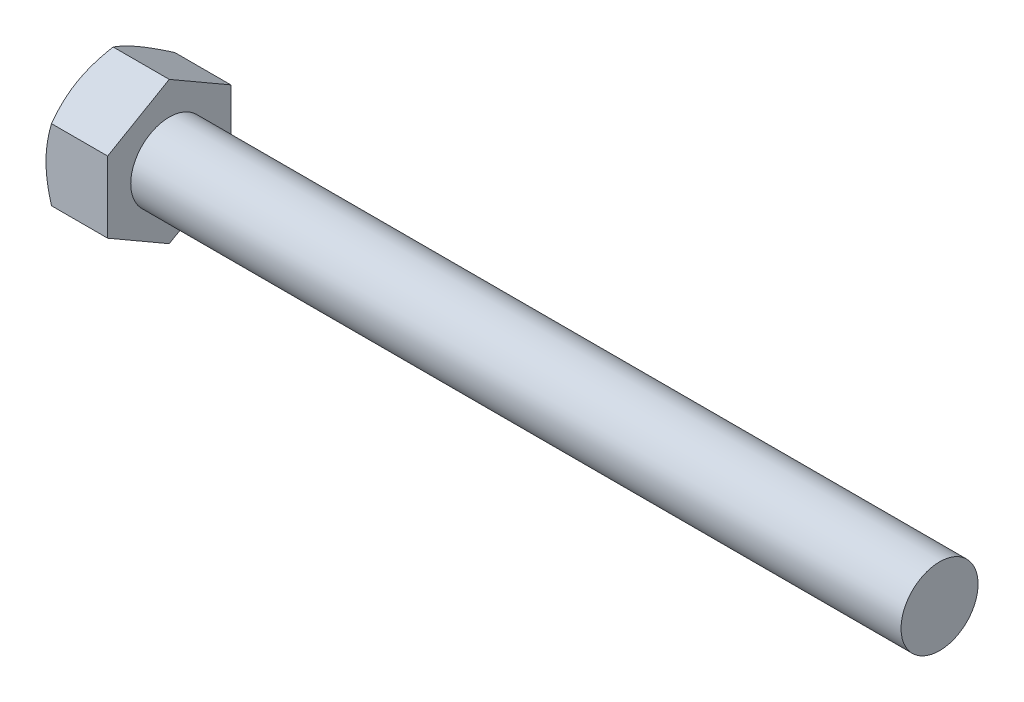
ISO-10303-21;
HEADER;
FILE_DESCRIPTION(('STEP AP214'),'2;1');
FILE_NAME('part.step','',(''),(''),'','','');
FILE_SCHEMA(('AUTOMOTIVE_DESIGN { 1 0 10303 214 1 1 1 1 }'));
ENDSEC;
DATA;
#1=APPLICATION_CONTEXT('core data for automotive mechanical design processes');
#2=APPLICATION_PROTOCOL_DEFINITION('international standard','automotive_design',2000,#1);
#3=PRODUCT_CONTEXT('',#1,'mechanical');
#4=PRODUCT('Part','Part','',(#3));
#5=PRODUCT_RELATED_PRODUCT_CATEGORY('part','',(#4));
#6=PRODUCT_DEFINITION_FORMATION('','',#4);
#7=PRODUCT_DEFINITION_CONTEXT('part definition',#1,'design');
#8=PRODUCT_DEFINITION('design','',#6,#7);
#9=PRODUCT_DEFINITION_SHAPE('','',#8);
#10=(LENGTH_UNIT() NAMED_UNIT(*) SI_UNIT(.MILLI.,.METRE.));
#11=(NAMED_UNIT(*) PLANE_ANGLE_UNIT() SI_UNIT($,.RADIAN.));
#12=(NAMED_UNIT(*) SI_UNIT($,.STERADIAN.) SOLID_ANGLE_UNIT());
#13=UNCERTAINTY_MEASURE_WITH_UNIT(LENGTH_MEASURE(1.E-05),#10,'distance_accuracy_value','');
#14=(GEOMETRIC_REPRESENTATION_CONTEXT(3) GLOBAL_UNCERTAINTY_ASSIGNED_CONTEXT((#13)) GLOBAL_UNIT_ASSIGNED_CONTEXT((#10,
#11,#12)) REPRESENTATION_CONTEXT('',''));
#15=CARTESIAN_POINT('',(0.,0.,0.));
#16=DIRECTION('',(0.,0.,1.));
#17=DIRECTION('',(1.,0.,0.));
#18=AXIS2_PLACEMENT_3D('',#15,#16,#17);
#19=CARTESIAN_POINT('',(0.,0.,0.));
#20=DIRECTION('',(-1.,0.,0.));
#21=DIRECTION('',(0.,0.,1.));
#22=AXIS2_PLACEMENT_3D('',#19,#20,#21);
#23=PLANE('',#22);
#24=CARTESIAN_POINT('',(0.,0.,0.));
#25=DIRECTION('',(-1.,0.,0.));
#26=DIRECTION('',(0.,0.,1.));
#27=AXIS2_PLACEMENT_3D('',#24,#25,#26);
#28=CIRCLE('',#27,1.6);
#29=CARTESIAN_POINT('',(0.,0.,1.6));
#30=VERTEX_POINT('',#29);
#31=CARTESIAN_POINT('',(0.,1.38564064908275,0.80000000524393));
#32=VERTEX_POINT('',#31);
#33=EDGE_CURVE('E42',#30,#32,#28,.T.);
#34=ORIENTED_EDGE('',*,*,#33,.T.);
#35=CARTESIAN_POINT('',(0.,1.38564064908275,-0.800000005243927));
#36=VERTEX_POINT('',#35);
#37=EDGE_CURVE('E198',#32,#36,#28,.T.);
#38=ORIENTED_EDGE('',*,*,#37,.T.);
#39=CARTESIAN_POINT('',(0.,0.,-1.59999999999999));
#40=VERTEX_POINT('',#39);
#41=EDGE_CURVE('E203',#36,#40,#28,.T.);
#42=ORIENTED_EDGE('',*,*,#41,.T.);
#43=CARTESIAN_POINT('',(0.,-1.38564064908255,-0.800000005243813));
#44=VERTEX_POINT('',#43);
#45=EDGE_CURVE('E207',#40,#44,#28,.T.);
#46=ORIENTED_EDGE('',*,*,#45,.T.);
#47=CARTESIAN_POINT('',(0.,-1.38564064908255,0.800000005243821));
#48=VERTEX_POINT('',#47);
#49=EDGE_CURVE('E204',#44,#48,#28,.T.);
#50=ORIENTED_EDGE('',*,*,#49,.T.);
#51=EDGE_CURVE('E196',#48,#30,#28,.T.);
#52=ORIENTED_EDGE('',*,*,#51,.T.);
#53=EDGE_LOOP('',(#34,#38,#42,#46,#50,#52));
#54=FACE_BOUND('',#53,.T.);
#55=CARTESIAN_POINT('',(0.,0.,0.));
#56=DIRECTION('',(1.,0.,0.));
#57=DIRECTION('',(0.,0.,-1.));
#58=AXIS2_PLACEMENT_3D('',#55,#56,#57);
#59=CIRCLE('',#58,1.4);
#60=CARTESIAN_POINT('',(0.,0.,-1.4));
#61=VERTEX_POINT('',#60);
#62=EDGE_CURVE('E235',#61,#61,#59,.T.);
#63=ORIENTED_EDGE('',*,*,#62,.T.);
#64=EDGE_LOOP('',(#63));
#65=FACE_BOUND('',#64,.T.);
#66=ADVANCED_FACE('F34',(#54,#65),#23,.T.);
#67=CARTESIAN_POINT('',(1.6,1.,0.));
#68=DIRECTION('',(-1.,0.,0.));
#69=DIRECTION('',(0.,0.,1.));
#70=AXIS2_PLACEMENT_3D('',#67,#68,#69);
#71=PLANE('',#70);
#72=CARTESIAN_POINT('',(1.6,0.,0.));
#73=DIRECTION('',(-1.,0.,0.));
#74=DIRECTION('',(0.,0.,1.));
#75=AXIS2_PLACEMENT_3D('',#72,#73,#74);
#76=CIRCLE('',#75,1.);
#77=CARTESIAN_POINT('',(1.6,0.,1.));
#78=VERTEX_POINT('',#77);
#79=EDGE_CURVE('E194',#78,#78,#76,.T.);
#80=ORIENTED_EDGE('',*,*,#79,.T.);
#81=EDGE_LOOP('',(#80));
#82=FACE_BOUND('',#81,.T.);
#83=DIRECTION('',(0.,1.,0.));
#84=VECTOR('',#83,1.);
#85=CARTESIAN_POINT('',(1.6,-0.923760434740008,1.59999999999999));
#86=LINE('',#85,#84);
#87=CARTESIAN_POINT('',(1.6,-0.923760434740008,1.59999999999999));
#88=VERTEX_POINT('',#87);
#89=CARTESIAN_POINT('',(1.6,0.923760434740265,1.60000000000001));
#90=VERTEX_POINT('',#89);
#91=EDGE_CURVE('E57',#88,#90,#86,.T.);
#92=ORIENTED_EDGE('',*,*,#91,.F.);
#93=DIRECTION('',(0.,0.500000001638713,0.866025402838327));
#94=VECTOR('',#93,1.);
#95=CARTESIAN_POINT('',(1.6,-1.84752086948014,0.));
#96=LINE('',#95,#94);
#97=CARTESIAN_POINT('',(1.6,-1.84752086948014,0.));
#98=VERTEX_POINT('',#97);
#99=EDGE_CURVE('E131',#98,#88,#96,.T.);
#100=ORIENTED_EDGE('',*,*,#99,.F.);
#101=DIRECTION('',(0.,-0.500000001638709,0.86602540283833));
#102=VECTOR('',#101,1.);
#103=CARTESIAN_POINT('',(1.6,-0.923760434740008,-1.59999999999999));
#104=LINE('',#103,#102);
#105=CARTESIAN_POINT('',(1.6,-0.923760434740008,-1.59999999999999));
#106=VERTEX_POINT('',#105);
#107=EDGE_CURVE('E129',#106,#98,#104,.T.);
#108=ORIENTED_EDGE('',*,*,#107,.F.);
#109=DIRECTION('',(0.,-1.,0.));
#110=VECTOR('',#109,1.);
#111=CARTESIAN_POINT('',(1.6,0.923760434740264,-1.59999999999999));
#112=LINE('',#111,#110);
#113=CARTESIAN_POINT('',(1.6,0.923760434740264,-1.59999999999999));
#114=VERTEX_POINT('',#113);
#115=EDGE_CURVE('E111',#114,#106,#112,.T.);
#116=ORIENTED_EDGE('',*,*,#115,.F.);
#117=DIRECTION('',(0.,-0.50000000163871,-0.866025402838329));
#118=VECTOR('',#117,1.);
#119=CARTESIAN_POINT('',(1.6,1.8475208694804,0.));
#120=LINE('',#119,#118);
#121=CARTESIAN_POINT('',(1.6,1.8475208694804,0.));
#122=VERTEX_POINT('',#121);
#123=EDGE_CURVE('E120',#122,#114,#120,.T.);
#124=ORIENTED_EDGE('',*,*,#123,.F.);
#125=DIRECTION('',(0.,0.500000001638711,-0.866025402838329));
#126=VECTOR('',#125,1.);
#127=CARTESIAN_POINT('',(1.6,0.923760434740265,1.60000000000001));
#128=LINE('',#127,#126);
#129=EDGE_CURVE('E124',#90,#122,#128,.T.);
#130=ORIENTED_EDGE('',*,*,#129,.F.);
#131=EDGE_LOOP('',(#92,#100,#108,#116,#124,#130));
#132=FACE_BOUND('',#131,.T.);
#133=ADVANCED_FACE('F126',(#82,#132),#71,.F.);
#134=CARTESIAN_POINT('',(-25.4,0.,0.));
#135=DIRECTION('',(-1.,0.,0.));
#136=DIRECTION('',(0.,0.,1.));
#137=AXIS2_PLACEMENT_3D('',#134,#135,#136);
#138=CYLINDRICAL_SURFACE('',#137,1.);
#139=CARTESIAN_POINT('',(21.6,0.,0.));
#140=DIRECTION('',(-1.,0.,0.));
#141=DIRECTION('',(0.,0.,1.));
#142=AXIS2_PLACEMENT_3D('',#139,#140,#141);
#143=CIRCLE('',#142,1.);
#144=CARTESIAN_POINT('',(21.6,0.,1.));
#145=VERTEX_POINT('',#144);
#146=EDGE_CURVE('E11',#145,#145,#143,.T.);
#147=ORIENTED_EDGE('',*,*,#146,.T.);
#148=EDGE_LOOP('',(#147));
#149=FACE_BOUND('',#148,.T.);
#150=ORIENTED_EDGE('',*,*,#79,.F.);
#151=EDGE_LOOP('',(#150));
#152=FACE_BOUND('',#151,.T.);
#153=ADVANCED_FACE('F36',(#149,#152),#138,.T.);
#154=CARTESIAN_POINT('',(21.6,1.,0.));
#155=DIRECTION('',(1.,0.,0.));
#156=DIRECTION('',(0.,0.,-1.));
#157=AXIS2_PLACEMENT_3D('',#154,#155,#156);
#158=PLANE('',#157);
#159=ORIENTED_EDGE('',*,*,#146,.F.);
#160=EDGE_LOOP('',(#159));
#161=FACE_BOUND('',#160,.T.);
#162=ADVANCED_FACE('F177',(#161),#158,.T.);
#163=CARTESIAN_POINT('',(1.6,-0.923760434740008,1.59999999999999));
#164=DIRECTION('',(0.,0.,1.));
#165=DIRECTION('',(0.,-1.,0.));
#166=AXIS2_PLACEMENT_3D('',#163,#164,#165);
#167=PLANE('',#166);
#168=DIRECTION('',(-1.,0.,0.));
#169=VECTOR('',#168,1.);
#170=CARTESIAN_POINT('',(1.6,-0.923760434740008,1.59999999999999));
#171=LINE('',#170,#169);
#172=CARTESIAN_POINT('',(0.142906237128529,-0.923760434740008,1.59999999999999));
#173=VERTEX_POINT('',#172);
#174=EDGE_CURVE('E138',#88,#173,#171,.T.);
#175=ORIENTED_EDGE('',*,*,#174,.F.);
#176=ORIENTED_EDGE('',*,*,#91,.T.);
#177=DIRECTION('',(-1.,0.,0.));
#178=VECTOR('',#177,1.);
#179=CARTESIAN_POINT('',(1.6,0.923760434740265,1.60000000000001));
#180=LINE('',#179,#178);
#181=CARTESIAN_POINT('',(0.142906237128609,0.923760434740265,1.60000000000001));
#182=VERTEX_POINT('',#181);
#183=EDGE_CURVE('E137',#90,#182,#180,.T.);
#184=ORIENTED_EDGE('',*,*,#183,.T.);
#185=CARTESIAN_POINT('',(0.76564482820217,-2.44995313964442,1.59999999999998));
#186=CARTESIAN_POINT('',(0.731696573650788,-2.37970405797874,1.59999999999998));
#187=CARTESIAN_POINT('',(0.698085791483837,-2.30928888479984,1.59999999999998));
#188=CARTESIAN_POINT('',(0.631732015267866,-2.16803654978858,1.59999999999999));
#189=CARTESIAN_POINT('',(0.598989171465685,-2.09719931746053,1.59999999999999));
#190=CARTESIAN_POINT('',(0.534391625180869,-1.95463040365835,1.59999999999999));
#191=CARTESIAN_POINT('',(0.502543077397532,-1.88289592340094,1.59999999999999));
#192=CARTESIAN_POINT('',(0.440213947600497,-1.73883737021894,1.59999999999999));
#193=CARTESIAN_POINT('',(0.409733294281394,-1.66651332825973,1.59999999999999));
#194=CARTESIAN_POINT('',(0.350141939702454,-1.52026304024921,1.59999999999999));
#195=CARTESIAN_POINT('',(0.321052643615888,-1.44632802431197,1.59999999999999));
#196=CARTESIAN_POINT('',(0.265152077517376,-1.29758535512184,1.59999999999999));
#197=CARTESIAN_POINT('',(0.23834107862231,-1.22277759921435,1.59999999999999));
#198=CARTESIAN_POINT('',(0.187718918744773,-1.0723280156514,1.59999999999999));
#199=CARTESIAN_POINT('',(0.16390125051531,-0.996688400121103,1.59999999999999));
#200=CARTESIAN_POINT('',(0.12003592931609,-0.844327663434869,1.59999999999999));
#201=CARTESIAN_POINT('',(0.099987393595572,-0.767606800049038,1.59999999999999));
#202=CARTESIAN_POINT('',(0.0646370585563159,-0.613040253227077,1.6));
#203=CARTESIAN_POINT('',(0.0493363268649872,-0.535194320912141,1.6));
#204=CARTESIAN_POINT('',(0.0245099593902603,-0.378564482285491,1.6));
#205=CARTESIAN_POINT('',(0.0149843287079903,-0.299780575145331,1.6));
#206=CARTESIAN_POINT('',(0.00255348836303608,-0.142183236095497,1.6));
#207=CARTESIAN_POINT('',(-0.000393634328578247,-0.0633732093612223,1.6));
#208=CARTESIAN_POINT('',(0.000479268304523157,0.0941836095219092,1.6));
#209=CARTESIAN_POINT('',(0.00429753699197446,0.172930412775564,1.6));
#210=CARTESIAN_POINT('',(0.0213790771551439,0.363434812047486,1.6));
#211=CARTESIAN_POINT('',(0.0379858383290392,0.47489323141449,1.6));
#212=CARTESIAN_POINT('',(0.081758789909099,0.695747937592885,1.6));
#213=CARTESIAN_POINT('',(0.108937403810865,0.805141638878415,1.60000000000001));
#214=CARTESIAN_POINT('',(0.155805981368532,0.968865723821624,1.60000000000001));
#215=CARTESIAN_POINT('',(0.172684493871448,1.02403323308235,1.60000000000001));
#216=CARTESIAN_POINT('',(0.208112276397475,1.13378937357028,1.60000000000001));
#217=CARTESIAN_POINT('',(0.226660394050073,1.18837837543755,1.60000000000001));
#218=CARTESIAN_POINT('',(0.265040726595984,1.29675310607402,1.60000000000001));
#219=CARTESIAN_POINT('',(0.284865126103112,1.35054162671599,1.60000000000001));
#220=CARTESIAN_POINT('',(0.325677517040839,1.45770134134686,1.60000000000001));
#221=CARTESIAN_POINT('',(0.346665978752046,1.51107235658079,1.60000000000001));
#222=CARTESIAN_POINT('',(0.368121670943104,1.56425000996125,1.60000000000001));
#223=B_SPLINE_CURVE_WITH_KNOTS('',3,(#185,#186,#187,#188,#189,#190,#191,#192,#193,#194,#195,
#196,#197,#198,#199,#200,#201,#202,#203,#204,#205,#206,#207,#208,#209,#210,#211,#212,#213,#214,
#215,#216,#217,#218,#219,#220,#221,#222),.UNSPECIFIED.,.F.,.F.,(4,2,2,2,2,2,2,2,2,2,2,2,2,2,2,2,
2,2,4),(0.,0.234068853234439,0.468177964432785,0.703626779940278,0.939063307715755,
1.17738940986821,1.4157438331752,1.65357078566774,1.89134196825098,2.12916657919322,
2.36699140020487,2.6032966124614,2.83954047694212,3.17691485506244,3.51468690177223,
3.68774177254085,3.86067810258333,4.03264103265922,4.20467394903791),.UNSPECIFIED.);
#224=EDGE_CURVE('E179',#30,#182,#223,.T.);
#225=ORIENTED_EDGE('',*,*,#224,.F.);
#226=EDGE_CURVE('E186',#173,#30,#223,.T.);
#227=ORIENTED_EDGE('',*,*,#226,.F.);
#228=EDGE_LOOP('',(#175,#176,#184,#225,#227));
#229=FACE_BOUND('',#228,.T.);
#230=ADVANCED_FACE('F173',(#229),#167,.T.);
#231=CARTESIAN_POINT('',(1.6,-1.84752086948014,0.));
#232=DIRECTION('',(0.,-0.866025402838328,0.500000001638713));
#233=DIRECTION('',(0.,-0.500000001638713,-0.866025402838328));
#234=AXIS2_PLACEMENT_3D('',#231,#232,#233);
#235=PLANE('',#234);
#236=DIRECTION('',(-1.,0.,0.));
#237=VECTOR('',#236,1.);
#238=CARTESIAN_POINT('',(1.6,-1.84752086948014,0.));
#239=LINE('',#238,#237);
#240=CARTESIAN_POINT('',(0.142906240624409,-1.84752086948014,0.));
#241=VERTEX_POINT('',#240);
#242=EDGE_CURVE('E142',#98,#241,#239,.T.);
#243=ORIENTED_EDGE('',*,*,#242,.F.);
#244=ORIENTED_EDGE('',*,*,#99,.T.);
#245=ORIENTED_EDGE('',*,*,#174,.T.);
#246=CARTESIAN_POINT('',(0.142972913540976,-1.84763633953448,-0.000199999999992873));
#247=CARTESIAN_POINT('',(0.119523873841058,-1.80704071400976,0.0701136856666137));
#248=CARTESIAN_POINT('',(0.0981973631752094,-1.76609467193232,0.141034310603666));
#249=CARTESIAN_POINT('',(0.0609706598519537,-1.68349347561588,0.284103778764524));
#250=CARTESIAN_POINT('',(0.0450836384739086,-1.64183685301446,0.356255165266608));
#251=CARTESIAN_POINT('',(0.0203517180934987,-1.55903989598294,0.499663700930613));
#252=CARTESIAN_POINT('',(0.0113422397924522,-1.51791230529269,0.570898777287732));
#253=CARTESIAN_POINT('',(0.000584274390864906,-1.43546347692821,0.713704336415487));
#254=CARTESIAN_POINT('',(-0.00117311856409631,-1.39414253919205,0.785274299678162));
#255=CARTESIAN_POINT('',(0.00247117592852546,-1.31692358067579,0.919021458551407));
#256=CARTESIAN_POINT('',(0.00697806184840445,-1.28101403562577,0.98121861478293));
#257=CARTESIAN_POINT('',(0.0212658787012254,-1.20942891036881,1.10520768825234));
#258=CARTESIAN_POINT('',(0.0310516964592369,-1.17375357800005,1.16699917622193));
#259=CARTESIAN_POINT('',(0.0555169133780065,-1.10202070318732,1.29124415942762));
#260=CARTESIAN_POINT('',(0.0703000817999975,-1.06597224567771,1.35368191909589));
#261=CARTESIAN_POINT('',(0.103852609308288,-0.994413170643862,1.47762587225554));
#262=CARTESIAN_POINT('',(0.122614078088374,-0.958901635419941,1.53913365524936));
#263=CARTESIAN_POINT('',(0.142972910044441,-0.923644964685665,1.60019999999999));
#264=B_SPLINE_CURVE_WITH_KNOTS('',3,(#246,#247,#248,#249,#250,#251,#252,#253,#254,#255,#256,
#257,#258,#259,#260,#261,#262,#263),.UNSPECIFIED.,.F.,.F.,(4,2,2,2,2,2,2,2,4),(0.,
0.253628623757861,0.507867115703996,0.755812450533006,1.0034532076744,1.21912892099053,
1.43500463361227,1.6556705890075,1.87590291613511),.UNSPECIFIED.);
#265=EDGE_CURVE('E188',#48,#173,#264,.T.);
#266=ORIENTED_EDGE('',*,*,#265,.F.);
#267=EDGE_CURVE('E187',#241,#48,#264,.T.);
#268=ORIENTED_EDGE('',*,*,#267,.F.);
#269=EDGE_LOOP('',(#243,#244,#245,#266,#268));
#270=FACE_BOUND('',#269,.T.);
#271=ADVANCED_FACE('F176',(#270),#235,.T.);
#272=CARTESIAN_POINT('',(1.6,-0.923760434740008,-1.59999999999999));
#273=DIRECTION('',(0.,-0.866025402838329,-0.500000001638709));
#274=DIRECTION('',(0.,0.500000001638709,-0.866025402838329));
#275=AXIS2_PLACEMENT_3D('',#272,#273,#274);
#276=PLANE('',#275);
#277=DIRECTION('',(-1.,0.,0.));
#278=VECTOR('',#277,1.);
#279=CARTESIAN_POINT('',(1.6,-0.923760434740008,-1.59999999999999));
#280=LINE('',#279,#278);
#281=CARTESIAN_POINT('',(0.142906237128529,-0.923760434740008,-1.59999999999999));
#282=VERTEX_POINT('',#281);
#283=EDGE_CURVE('E117',#106,#282,#280,.T.);
#284=ORIENTED_EDGE('',*,*,#283,.F.);
#285=ORIENTED_EDGE('',*,*,#107,.T.);
#286=ORIENTED_EDGE('',*,*,#242,.T.);
#287=CARTESIAN_POINT('',(0.142972910044441,-0.923644964685665,-1.60019999999999));
#288=CARTESIAN_POINT('',(0.119523870629406,-0.964240590112126,-1.52988631450359));
#289=CARTESIAN_POINT('',(0.0981973602666705,-1.00518663209069,-1.45896568973779));
#290=CARTESIAN_POINT('',(0.0609706575736128,-1.0877878281999,-1.31589622193587));
#291=CARTESIAN_POINT('',(0.0450836365223247,-1.1294444506929,-1.24374483562157));
#292=CARTESIAN_POINT('',(0.0203517167922119,-1.21224140750353,-1.10033630034016));
#293=CARTESIAN_POINT('',(0.0113422388152973,-1.25336899808164,-1.02910122417727));
#294=CARTESIAN_POINT('',(0.000584274038667554,-1.3358178262086,-0.886295665460907));
#295=CARTESIAN_POINT('',(-0.00117311861527016,-1.3771387638194,-0.814725702415362));
#296=CARTESIAN_POINT('',(0.00247117640136974,-1.45435772233075,-0.680978543550619));
#297=CARTESIAN_POINT('',(0.00697806258842543,-1.49026726750218,-0.618781387108805));
#298=CARTESIAN_POINT('',(0.0212658799891509,-1.56185239299221,-0.494792313235705));
#299=CARTESIAN_POINT('',(0.0310516980279462,-1.59752772547262,-0.433000825072742));
#300=CARTESIAN_POINT('',(0.0555169155108641,-1.66926060050637,-0.308755841484226));
#301=CARTESIAN_POINT('',(0.0703000842165094,-1.70530905812515,-0.24631808162686));
#302=CARTESIAN_POINT('',(0.103852612277743,-1.77686813337112,-0.122374128099821));
#303=CARTESIAN_POINT('',(0.122614081327006,-1.81237966869801,-0.0608663449276544));
#304=CARTESIAN_POINT('',(0.142972913540976,-1.84763633953448,0.000200000000007026));
#305=B_SPLINE_CURVE_WITH_KNOTS('',3,(#287,#288,#289,#290,#291,#292,#293,#294,#295,#296,#297,
#298,#299,#300,#301,#302,#303,#304),.UNSPECIFIED.,.F.,.F.,(4,2,2,2,2,2,2,2,4),(0.,
0.253628622953061,0.507867114074839,0.755812448128856,1.00345320450202,1.21912891859406,
1.4350046319942,1.65567058820306,1.87590291613512),.UNSPECIFIED.);
#306=EDGE_CURVE('E217',#44,#241,#305,.T.);
#307=ORIENTED_EDGE('',*,*,#306,.F.);
#308=EDGE_CURVE('E222',#282,#44,#305,.T.);
#309=ORIENTED_EDGE('',*,*,#308,.F.);
#310=EDGE_LOOP('',(#284,#285,#286,#307,#309));
#311=FACE_BOUND('',#310,.T.);
#312=ADVANCED_FACE('F294',(#311),#276,.T.);
#313=CARTESIAN_POINT('',(1.6,0.923760434740264,-1.59999999999999));
#314=DIRECTION('',(0.,0.,-1.));
#315=DIRECTION('',(-1.,0.,0.));
#316=AXIS2_PLACEMENT_3D('',#313,#314,#315);
#317=PLANE('',#316);
#318=DIRECTION('',(-1.,0.,0.));
#319=VECTOR('',#318,1.);
#320=CARTESIAN_POINT('',(1.6,0.923760434740264,-1.59999999999999));
#321=LINE('',#320,#319);
#322=CARTESIAN_POINT('',(0.142906237128603,0.923760434740264,-1.59999999999999));
#323=VERTEX_POINT('',#322);
#324=EDGE_CURVE('E106',#114,#323,#321,.T.);
#325=ORIENTED_EDGE('',*,*,#324,.F.);
#326=ORIENTED_EDGE('',*,*,#115,.T.);
#327=ORIENTED_EDGE('',*,*,#283,.T.);
#328=CARTESIAN_POINT('',(0.765644828202172,-2.44995313964441,-1.59999999999999));
#329=CARTESIAN_POINT('',(0.731696573650789,-2.37970405797873,-1.59999999999999));
#330=CARTESIAN_POINT('',(0.698085791483839,-2.30928888479984,-1.59999999999999));
#331=CARTESIAN_POINT('',(0.631732015267867,-2.16803654978858,-1.59999999999999));
#332=CARTESIAN_POINT('',(0.598989171465686,-2.09719931746053,-1.59999999999999));
#333=CARTESIAN_POINT('',(0.53439162518087,-1.95463040365835,-1.59999999999999));
#334=CARTESIAN_POINT('',(0.502543077397533,-1.88289592340093,-1.59999999999999));
#335=CARTESIAN_POINT('',(0.440213947600498,-1.73883737021894,-1.59999999999999));
#336=CARTESIAN_POINT('',(0.409733294281395,-1.66651332825973,-1.59999999999999));
#337=CARTESIAN_POINT('',(0.350141939702454,-1.52026304024921,-1.59999999999999));
#338=CARTESIAN_POINT('',(0.321052643615888,-1.44632802431197,-1.59999999999999));
#339=CARTESIAN_POINT('',(0.265152077517377,-1.29758535512183,-1.59999999999999));
#340=CARTESIAN_POINT('',(0.23834107862231,-1.22277759921435,-1.59999999999999));
#341=CARTESIAN_POINT('',(0.187718918744773,-1.07232801565139,-1.59999999999999));
#342=CARTESIAN_POINT('',(0.16390125051531,-0.996688400121102,-1.59999999999999));
#343=CARTESIAN_POINT('',(0.12003592931609,-0.844327663434868,-1.59999999999999));
#344=CARTESIAN_POINT('',(0.0999873935955714,-0.767606800049037,-1.59999999999999));
#345=CARTESIAN_POINT('',(0.064637058556315,-0.613040253227077,-1.59999999999999));
#346=CARTESIAN_POINT('',(0.049336326864986,-0.535194320912141,-1.59999999999999));
#347=CARTESIAN_POINT('',(0.0245099593902585,-0.378564482285492,-1.59999999999999));
#348=CARTESIAN_POINT('',(0.0149843287079881,-0.299780575145332,-1.59999999999999));
#349=CARTESIAN_POINT('',(0.00255348836303317,-0.142183236095499,-1.59999999999999));
#350=CARTESIAN_POINT('',(-0.000393634328581472,-0.0633732093612241,-1.59999999999999));
#351=CARTESIAN_POINT('',(0.000479268304519255,0.0941836095219075,-1.59999999999999));
#352=CARTESIAN_POINT('',(0.00429753699197019,0.172930412775563,-1.59999999999999));
#353=CARTESIAN_POINT('',(0.0213790771551387,0.363434812047484,-1.59999999999999));
#354=CARTESIAN_POINT('',(0.0379858383290335,0.474893231414486,-1.59999999999999));
#355=CARTESIAN_POINT('',(0.081758789909092,0.695747937592879,-1.59999999999999));
#356=CARTESIAN_POINT('',(0.108937403810858,0.805141638878409,-1.59999999999999));
#357=CARTESIAN_POINT('',(0.155805981368524,0.968865723821616,-1.59999999999999));
#358=CARTESIAN_POINT('',(0.17268449387144,1.02403323308235,-1.59999999999999));
#359=CARTESIAN_POINT('',(0.208112276397465,1.13378937357027,-1.59999999999999));
#360=CARTESIAN_POINT('',(0.226660394050063,1.18837837543754,-1.59999999999999));
#361=CARTESIAN_POINT('',(0.265040726595973,1.29675310607401,-1.59999999999999));
#362=CARTESIAN_POINT('',(0.284865126103101,1.35054162671598,-1.59999999999999));
#363=CARTESIAN_POINT('',(0.325677517040828,1.45770134134684,-1.59999999999999));
#364=CARTESIAN_POINT('',(0.346665978752034,1.51107235658077,-1.59999999999999));
#365=CARTESIAN_POINT('',(0.368121670943091,1.56425000996124,-1.59999999999999));
#366=B_SPLINE_CURVE_WITH_KNOTS('',3,(#328,#329,#330,#331,#332,#333,#334,#335,#336,#337,#338,
#339,#340,#341,#342,#343,#344,#345,#346,#347,#348,#349,#350,#351,#352,#353,#354,#355,#356,#357,
#358,#359,#360,#361,#362,#363,#364,#365),.UNSPECIFIED.,.F.,.F.,(4,2,2,2,2,2,2,2,2,2,2,2,2,2,2,2,
2,2,4),(0.,0.23406885323444,0.468177964432785,0.703626779940279,0.939063307715756,
1.17738940986821,1.4157438331752,1.65357078566774,1.89134196825097,2.12916657919322,
2.36699140020487,2.6032966124614,2.83954047694212,3.17691485506243,3.51468690177222,
3.68774177254083,3.86067810258332,4.0326410326592,4.20467394903789),.UNSPECIFIED.);
#367=EDGE_CURVE('E218',#40,#282,#366,.F.);
#368=ORIENTED_EDGE('',*,*,#367,.F.);
#369=EDGE_CURVE('E114',#323,#40,#366,.F.);
#370=ORIENTED_EDGE('',*,*,#369,.F.);
#371=EDGE_LOOP('',(#325,#326,#327,#368,#370));
#372=FACE_BOUND('',#371,.T.);
#373=ADVANCED_FACE('F108',(#372),#317,.T.);
#374=CARTESIAN_POINT('',(1.6,1.8475208694804,0.));
#375=DIRECTION('',(0.,0.866025402838329,-0.50000000163871));
#376=DIRECTION('',(0.,0.50000000163871,0.866025402838329));
#377=AXIS2_PLACEMENT_3D('',#374,#375,#376);
#378=PLANE('',#377);
#379=DIRECTION('',(-1.,0.,0.));
#380=VECTOR('',#379,1.);
#381=CARTESIAN_POINT('',(1.6,1.8475208694804,0.));
#382=LINE('',#381,#380);
#383=CARTESIAN_POINT('',(0.142906240624558,1.8475208694804,0.));
#384=VERTEX_POINT('',#383);
#385=EDGE_CURVE('E49',#122,#384,#382,.T.);
#386=ORIENTED_EDGE('',*,*,#385,.F.);
#387=ORIENTED_EDGE('',*,*,#123,.T.);
#388=ORIENTED_EDGE('',*,*,#324,.T.);
#389=CARTESIAN_POINT('',(0.142972913541125,1.84763633953474,0.000200000000006804));
#390=CARTESIAN_POINT('',(0.119523873841203,1.80704071401001,-0.0701136856666097));
#391=CARTESIAN_POINT('',(0.098197363175352,1.76609467193257,-0.141034310603672));
#392=CARTESIAN_POINT('',(0.0609706598520907,1.68349347561611,-0.28410377876455));
#393=CARTESIAN_POINT('',(0.0450836384740431,1.64183685301469,-0.356255165266644));
#394=CARTESIAN_POINT('',(0.0203517180936293,1.55903989598316,-0.499663700930668));
#395=CARTESIAN_POINT('',(0.0113422397925813,1.5179123052929,-0.570898777287798));
#396=CARTESIAN_POINT('',(0.000584274390991968,1.43546347692842,-0.713704336415573));
#397=CARTESIAN_POINT('',(-0.00117311856396976,1.39414253919224,-0.785274299678259));
#398=CARTESIAN_POINT('',(0.00247117592865156,1.31692358067599,-0.919021458551505));
#399=CARTESIAN_POINT('',(0.00697806184852886,1.28101403562597,-0.981218614783018));
#400=CARTESIAN_POINT('',(0.0212658787013442,1.20942891036903,-1.10520768825241));
#401=CARTESIAN_POINT('',(0.0310516964593518,1.17375357800027,-1.16699917622199));
#402=CARTESIAN_POINT('',(0.0555169133781119,1.10202070318754,-1.29124415942767));
#403=CARTESIAN_POINT('',(0.0703000818000975,1.06597224567795,-1.35368191909593));
#404=CARTESIAN_POINT('',(0.103852609308376,0.994413170644108,-1.47762587225555));
#405=CARTESIAN_POINT('',(0.122614078088455,0.958901635420191,-1.53913365524936));
#406=CARTESIAN_POINT('',(0.142972910044515,0.923644964685921,-1.60019999999999));
#407=B_SPLINE_CURVE_WITH_KNOTS('',3,(#389,#390,#391,#392,#393,#394,#395,#396,#397,#398,#399,
#400,#401,#402,#403,#404,#405,#406),.UNSPECIFIED.,.F.,.F.,(4,2,2,2,2,2,2,2,4),(0.,
0.253628623757896,0.507867115704066,0.755812450533111,1.00345320767454,1.21912892099064,
1.43500463361235,1.65567058900755,1.87590291613512),.UNSPECIFIED.);
#408=EDGE_CURVE('E156',#36,#323,#407,.T.);
#409=ORIENTED_EDGE('',*,*,#408,.F.);
#410=EDGE_CURVE('E381',#384,#36,#407,.T.);
#411=ORIENTED_EDGE('',*,*,#410,.F.);
#412=EDGE_LOOP('',(#386,#387,#388,#409,#411));
#413=FACE_BOUND('',#412,.T.);
#414=ADVANCED_FACE('F121',(#413),#378,.T.);
#415=CARTESIAN_POINT('',(1.6,0.923760434740265,1.60000000000001));
#416=DIRECTION('',(0.,0.866025402838329,0.500000001638711));
#417=DIRECTION('',(0.,-0.500000001638711,0.866025402838329));
#418=AXIS2_PLACEMENT_3D('',#415,#416,#417);
#419=PLANE('',#418);
#420=ORIENTED_EDGE('',*,*,#183,.F.);
#421=ORIENTED_EDGE('',*,*,#129,.T.);
#422=ORIENTED_EDGE('',*,*,#385,.T.);
#423=CARTESIAN_POINT('',(0.142972910044521,0.923644964685922,1.60020000000001));
#424=CARTESIAN_POINT('',(0.119523870629489,0.964240590112387,1.5298863145036));
#425=CARTESIAN_POINT('',(0.0981973602667564,1.00518663209095,1.45896568973779));
#426=CARTESIAN_POINT('',(0.0609706575737065,1.08778782820017,1.31589622193586));
#427=CARTESIAN_POINT('',(0.0450836365224231,1.12944445069318,1.24374483562155));
#428=CARTESIAN_POINT('',(0.0203517167923203,1.21224140750381,1.10033630034013));
#429=CARTESIAN_POINT('',(0.0113422388154111,1.25336899808193,1.02910122417723));
#430=CARTESIAN_POINT('',(0.000584274038792916,1.33581782620889,0.886295665460856));
#431=CARTESIAN_POINT('',(-0.00117311861513881,1.3771387638197,0.814725702415306));
#432=CARTESIAN_POINT('',(0.00247117640151199,1.45435772233105,0.680978543550564));
#433=CARTESIAN_POINT('',(0.00697806258857162,1.49026726750247,0.618781387108756));
#434=CARTESIAN_POINT('',(0.0212658799893028,1.56185239299249,0.494792313235668));
#435=CARTESIAN_POINT('',(0.0310516980280999,1.5975277254729,0.433000825072711));
#436=CARTESIAN_POINT('',(0.0555169155110196,1.66926060050665,0.308755841484208));
#437=CARTESIAN_POINT('',(0.0703000842166648,1.70530905812542,0.246318081626849));
#438=CARTESIAN_POINT('',(0.103852612277897,1.77686813337138,0.122374128099823));
#439=CARTESIAN_POINT('',(0.122614081327158,1.81237966869827,0.0608663449276622));
#440=CARTESIAN_POINT('',(0.142972913541125,1.84763633953474,-0.000199999999993092));
#441=B_SPLINE_CURVE_WITH_KNOTS('',3,(#423,#424,#425,#426,#427,#428,#429,#430,#431,#432,#433,
#434,#435,#436,#437,#438,#439,#440),.UNSPECIFIED.,.F.,.F.,(4,2,2,2,2,2,2,2,4),(0.,
0.253628622953081,0.507867114074878,0.755812448128915,1.00345320450209,1.21912891859411,
1.43500463199424,1.65567058820308,1.87590291613511),.UNSPECIFIED.);
#442=EDGE_CURVE('E141',#32,#384,#441,.T.);
#443=ORIENTED_EDGE('',*,*,#442,.F.);
#444=EDGE_CURVE('E155',#182,#32,#441,.T.);
#445=ORIENTED_EDGE('',*,*,#444,.F.);
#446=EDGE_LOOP('',(#420,#421,#422,#443,#445));
#447=FACE_BOUND('',#446,.T.);
#448=ADVANCED_FACE('F166',(#447),#419,.T.);
#449=CARTESIAN_POINT('',(0.,0.,0.));
#450=DIRECTION('',(1.,0.,0.));
#451=DIRECTION('',(0.,0.,-1.));
#452=AXIS2_PLACEMENT_3D('',#449,#450,#451);
#453=CONICAL_SURFACE('',#452,1.6,1.0471975511966);
#454=ORIENTED_EDGE('',*,*,#51,.F.);
#455=ORIENTED_EDGE('',*,*,#265,.T.);
#456=ORIENTED_EDGE('',*,*,#226,.T.);
#457=EDGE_LOOP('',(#454,#455,#456));
#458=FACE_BOUND('',#457,.T.);
#459=ADVANCED_FACE('F170',(#458),#453,.T.);
#460=ORIENTED_EDGE('',*,*,#49,.F.);
#461=ORIENTED_EDGE('',*,*,#306,.T.);
#462=ORIENTED_EDGE('',*,*,#267,.T.);
#463=EDGE_LOOP('',(#460,#461,#462));
#464=FACE_BOUND('',#463,.T.);
#465=ADVANCED_FACE('F227',(#464),#453,.T.);
#466=ORIENTED_EDGE('',*,*,#367,.T.);
#467=ORIENTED_EDGE('',*,*,#308,.T.);
#468=ORIENTED_EDGE('',*,*,#45,.F.);
#469=EDGE_LOOP('',(#466,#467,#468));
#470=FACE_BOUND('',#469,.T.);
#471=ADVANCED_FACE('F162',(#470),#453,.T.);
#472=ORIENTED_EDGE('',*,*,#408,.T.);
#473=ORIENTED_EDGE('',*,*,#369,.T.);
#474=ORIENTED_EDGE('',*,*,#41,.F.);
#475=EDGE_LOOP('',(#472,#473,#474));
#476=FACE_BOUND('',#475,.T.);
#477=ADVANCED_FACE('F216',(#476),#453,.T.);
#478=ORIENTED_EDGE('',*,*,#33,.F.);
#479=ORIENTED_EDGE('',*,*,#224,.T.);
#480=ORIENTED_EDGE('',*,*,#444,.T.);
#481=EDGE_LOOP('',(#478,#479,#480));
#482=FACE_BOUND('',#481,.T.);
#483=ADVANCED_FACE('F253',(#482),#453,.T.);
#484=ORIENTED_EDGE('',*,*,#442,.T.);
#485=ORIENTED_EDGE('',*,*,#410,.T.);
#486=ORIENTED_EDGE('',*,*,#37,.F.);
#487=EDGE_LOOP('',(#484,#485,#486));
#488=FACE_BOUND('',#487,.T.);
#489=ADVANCED_FACE('F244',(#488),#453,.T.);
#490=CARTESIAN_POINT('',(0.2,0.,0.));
#491=DIRECTION('',(-1.,0.,0.));
#492=DIRECTION('',(0.,0.,1.));
#493=AXIS2_PLACEMENT_3D('',#490,#491,#492);
#494=CYLINDRICAL_SURFACE('',#493,1.4);
#495=CARTESIAN_POINT('',(0.2,0.,0.));
#496=DIRECTION('',(1.,0.,0.));
#497=DIRECTION('',(0.,0.,-1.));
#498=AXIS2_PLACEMENT_3D('',#495,#496,#497);
#499=CIRCLE('',#498,1.4);
#500=CARTESIAN_POINT('',(0.2,0.,-1.4));
#501=VERTEX_POINT('',#500);
#502=EDGE_CURVE('E232',#501,#501,#499,.T.);
#503=ORIENTED_EDGE('',*,*,#502,.T.);
#504=EDGE_LOOP('',(#503));
#505=FACE_BOUND('',#504,.T.);
#506=ORIENTED_EDGE('',*,*,#62,.F.);
#507=EDGE_LOOP('',(#506));
#508=FACE_BOUND('',#507,.T.);
#509=ADVANCED_FACE('F241',(#505,#508),#494,.F.);
#510=CARTESIAN_POINT('',(0.2,0.,0.));
#511=DIRECTION('',(1.,0.,0.));
#512=DIRECTION('',(0.,0.,-1.));
#513=AXIS2_PLACEMENT_3D('',#510,#511,#512);
#514=PLANE('',#513);
#515=ORIENTED_EDGE('',*,*,#502,.F.);
#516=EDGE_LOOP('',(#515));
#517=FACE_BOUND('',#516,.T.);
#518=ADVANCED_FACE('F243',(#517),#514,.F.);
#519=CLOSED_SHELL('',(#66,#133,#153,#162,#230,#271,#312,#373,#414,#448,#459,#465,#471,#477,#483,
#489,#509,#518));
#520=MANIFOLD_SOLID_BREP('B2',#519);
#521=ADVANCED_BREP_SHAPE_REPRESENTATION('',(#18,#520),#14);
#522=SHAPE_DEFINITION_REPRESENTATION(#9,#521);
ENDSEC;
END-ISO-10303-21;
